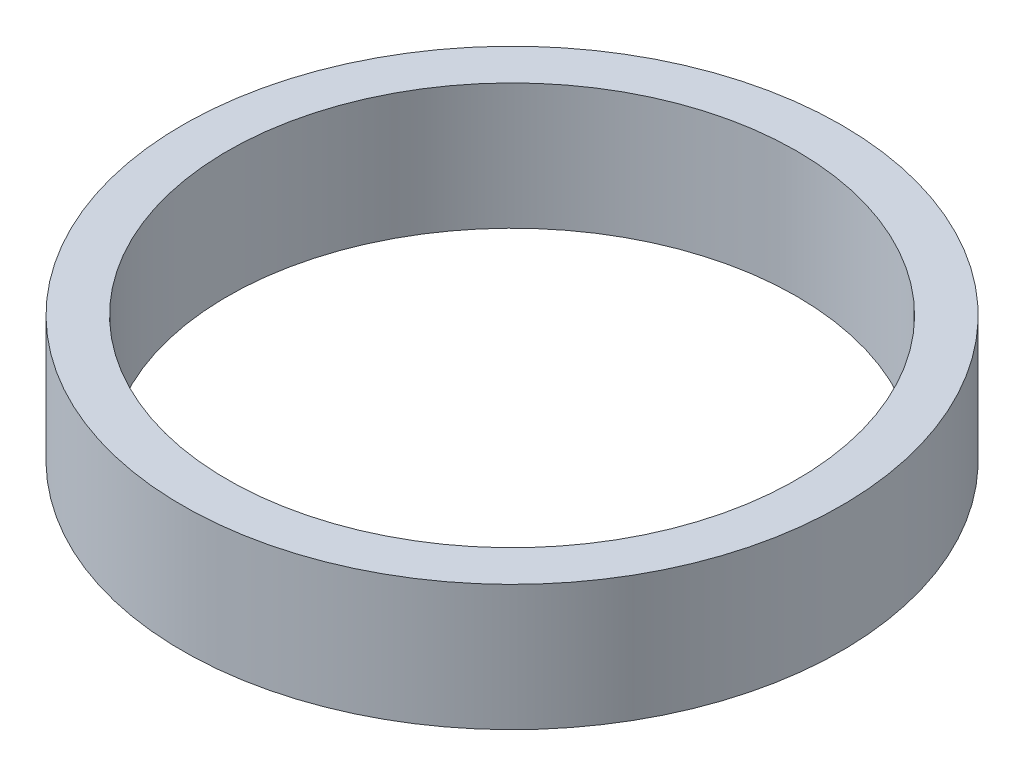
ISO-10303-21;
HEADER;
FILE_DESCRIPTION(('STEP AP214'),'2;1');
FILE_NAME('part.step','',(''),(''),'','','');
FILE_SCHEMA(('AUTOMOTIVE_DESIGN { 1 0 10303 214 1 1 1 1 }'));
ENDSEC;
DATA;
#1=APPLICATION_CONTEXT('core data for automotive mechanical design processes');
#2=APPLICATION_PROTOCOL_DEFINITION('international standard','automotive_design',2000,#1);
#3=PRODUCT_CONTEXT('',#1,'mechanical');
#4=PRODUCT('Part','Part','',(#3));
#5=PRODUCT_RELATED_PRODUCT_CATEGORY('part','',(#4));
#6=PRODUCT_DEFINITION_FORMATION('','',#4);
#7=PRODUCT_DEFINITION_CONTEXT('part definition',#1,'design');
#8=PRODUCT_DEFINITION('design','',#6,#7);
#9=PRODUCT_DEFINITION_SHAPE('','',#8);
#10=(LENGTH_UNIT() NAMED_UNIT(*) SI_UNIT(.MILLI.,.METRE.));
#11=(NAMED_UNIT(*) PLANE_ANGLE_UNIT() SI_UNIT($,.RADIAN.));
#12=(NAMED_UNIT(*) SI_UNIT($,.STERADIAN.) SOLID_ANGLE_UNIT());
#13=UNCERTAINTY_MEASURE_WITH_UNIT(LENGTH_MEASURE(1.E-05),#10,'distance_accuracy_value','');
#14=(GEOMETRIC_REPRESENTATION_CONTEXT(3) GLOBAL_UNCERTAINTY_ASSIGNED_CONTEXT((#13)) GLOBAL_UNIT_ASSIGNED_CONTEXT((#10,
#11,#12)) REPRESENTATION_CONTEXT('',''));
#15=CARTESIAN_POINT('',(0.,0.,0.));
#16=DIRECTION('',(0.,0.,1.));
#17=DIRECTION('',(1.,0.,0.));
#18=AXIS2_PLACEMENT_3D('',#15,#16,#17);
#19=CARTESIAN_POINT('',(0.,21.,0.));
#20=DIRECTION('',(0.,-1.,0.));
#21=DIRECTION('',(0.,0.,-1.));
#22=AXIS2_PLACEMENT_3D('',#19,#20,#21);
#23=CYLINDRICAL_SURFACE('',#22,55.);
#24=CARTESIAN_POINT('',(0.,21.,0.));
#25=DIRECTION('',(0.,1.,0.));
#26=DIRECTION('',(0.,0.,1.));
#27=AXIS2_PLACEMENT_3D('',#24,#25,#26);
#28=CIRCLE('',#27,55.);
#29=CARTESIAN_POINT('',(0.,21.,-55.));
#30=VERTEX_POINT('',#29);
#31=EDGE_CURVE('E10',#30,#30,#28,.T.);
#32=CARTESIAN_POINT('',(0.,0.,0.));
#33=DIRECTION('',(0.,1.,0.));
#34=DIRECTION('',(0.,0.,1.));
#35=AXIS2_PLACEMENT_3D('',#32,#33,#34);
#36=CIRCLE('',#35,55.);
#37=CARTESIAN_POINT('',(0.,0.,-55.));
#38=VERTEX_POINT('',#37);
#39=EDGE_CURVE('E37',#38,#38,#36,.T.);
#40=CARTESIAN_POINT('',(0.,21.,-55.));
#41=CARTESIAN_POINT('',(0.,20.78125,-55.));
#42=CARTESIAN_POINT('',(0.,20.5625,-55.));
#43=CARTESIAN_POINT('',(0.,20.125,-55.));
#44=CARTESIAN_POINT('',(0.,19.90625,-55.));
#45=CARTESIAN_POINT('',(0.,19.46875,-55.));
#46=CARTESIAN_POINT('',(0.,19.25,-55.));
#47=CARTESIAN_POINT('',(0.,18.8125,-55.));
#48=CARTESIAN_POINT('',(0.,18.59375,-55.));
#49=CARTESIAN_POINT('',(0.,18.15625,-55.));
#50=CARTESIAN_POINT('',(0.,17.9375,-55.));
#51=CARTESIAN_POINT('',(0.,17.5,-55.));
#52=CARTESIAN_POINT('',(0.,17.28125,-55.));
#53=CARTESIAN_POINT('',(0.,16.84375,-55.));
#54=CARTESIAN_POINT('',(0.,16.625,-55.));
#55=CARTESIAN_POINT('',(0.,16.1875,-55.));
#56=CARTESIAN_POINT('',(0.,15.96875,-55.));
#57=CARTESIAN_POINT('',(0.,15.53125,-55.));
#58=CARTESIAN_POINT('',(0.,15.3125,-55.));
#59=CARTESIAN_POINT('',(0.,14.875,-55.));
#60=CARTESIAN_POINT('',(0.,14.65625,-55.));
#61=CARTESIAN_POINT('',(0.,14.21875,-55.));
#62=CARTESIAN_POINT('',(0.,14.,-55.));
#63=CARTESIAN_POINT('',(0.,13.5625,-55.));
#64=CARTESIAN_POINT('',(0.,13.34375,-55.));
#65=CARTESIAN_POINT('',(0.,12.90625,-55.));
#66=CARTESIAN_POINT('',(0.,12.6875,-55.));
#67=CARTESIAN_POINT('',(0.,12.25,-55.));
#68=CARTESIAN_POINT('',(0.,12.03125,-55.));
#69=CARTESIAN_POINT('',(0.,11.59375,-55.));
#70=CARTESIAN_POINT('',(0.,11.375,-55.));
#71=CARTESIAN_POINT('',(0.,10.9375,-55.));
#72=CARTESIAN_POINT('',(0.,10.71875,-55.));
#73=CARTESIAN_POINT('',(0.,10.28125,-55.));
#74=CARTESIAN_POINT('',(0.,10.0625,-55.));
#75=CARTESIAN_POINT('',(0.,9.625,-55.));
#76=CARTESIAN_POINT('',(0.,9.40625,-55.));
#77=CARTESIAN_POINT('',(0.,8.96875,-55.));
#78=CARTESIAN_POINT('',(0.,8.75,-55.));
#79=CARTESIAN_POINT('',(0.,8.3125,-55.));
#80=CARTESIAN_POINT('',(0.,8.09375,-55.));
#81=CARTESIAN_POINT('',(0.,7.65625,-55.));
#82=CARTESIAN_POINT('',(0.,7.4375,-55.));
#83=CARTESIAN_POINT('',(0.,7.,-55.));
#84=CARTESIAN_POINT('',(0.,6.78125,-55.));
#85=CARTESIAN_POINT('',(0.,6.34375,-55.));
#86=CARTESIAN_POINT('',(0.,6.125,-55.));
#87=CARTESIAN_POINT('',(0.,5.6875,-55.));
#88=CARTESIAN_POINT('',(0.,5.46875,-55.));
#89=CARTESIAN_POINT('',(0.,5.03125,-55.));
#90=CARTESIAN_POINT('',(0.,4.8125,-55.));
#91=CARTESIAN_POINT('',(0.,4.375,-55.));
#92=CARTESIAN_POINT('',(0.,4.15625,-55.));
#93=CARTESIAN_POINT('',(0.,3.71875,-55.));
#94=CARTESIAN_POINT('',(0.,3.5,-55.));
#95=CARTESIAN_POINT('',(0.,3.0625,-55.));
#96=CARTESIAN_POINT('',(0.,2.84375,-55.));
#97=CARTESIAN_POINT('',(0.,2.40625,-55.));
#98=CARTESIAN_POINT('',(0.,2.1875,-55.));
#99=CARTESIAN_POINT('',(0.,1.75,-55.));
#100=CARTESIAN_POINT('',(0.,1.53125,-55.));
#101=CARTESIAN_POINT('',(0.,1.09375,-55.));
#102=CARTESIAN_POINT('',(0.,0.875000000000001,-55.));
#103=CARTESIAN_POINT('',(0.,0.4375,-55.));
#104=CARTESIAN_POINT('',(0.,0.21875,-55.));
#105=CARTESIAN_POINT('',(0.,0.,-55.));
#106=B_SPLINE_CURVE_WITH_KNOTS('',3,(#40,#41,#42,#43,#44,#45,#46,#47,#48,#49,#50,#51,#52,#53,
#54,#55,#56,#57,#58,#59,#60,#61,#62,#63,#64,#65,#66,#67,#68,#69,#70,#71,#72,#73,#74,#75,#76,#77,
#78,#79,#80,#81,#82,#83,#84,#85,#86,#87,#88,#89,#90,#91,#92,#93,#94,#95,#96,#97,#98,#99,#100,
#101,#102,#103,#104,#105),.UNSPECIFIED.,.F.,.F.,(4,2,2,2,2,2,2,2,2,2,2,2,2,2,2,2,2,2,2,2,2,2,2,
2,2,2,2,2,2,2,2,2,4),(0.,0.656250000000001,1.3125,1.96875,2.625,3.28125,3.9375,4.59375,5.25,
5.90625,6.5625,7.21875,7.875,8.53125,9.1875,9.84375,10.5,11.15625,11.8125,12.46875,13.125,
13.78125,14.4375,15.09375,15.75,16.40625,17.0625,17.71875,18.375,19.03125,19.6875,20.34375,21.),.UNSPECIFIED.);
#107=EDGE_CURVE('BSEAM40',#30,#38,#106,.T.);
#108=ORIENTED_EDGE('',*,*,#31,.F.);
#109=ORIENTED_EDGE('',*,*,#39,.T.);
#110=ORIENTED_EDGE('',*,*,#107,.T.);
#111=ORIENTED_EDGE('',*,*,#107,.F.);
#112=EDGE_LOOP('',(#108,#110,#109,#111));
#113=FACE_BOUND('',#112,.T.);
#114=ADVANCED_FACE('F40',(#113),#23,.T.);
#115=CARTESIAN_POINT('',(0.,21.,0.));
#116=DIRECTION('',(0.,1.,0.));
#117=DIRECTION('',(0.,0.,1.));
#118=AXIS2_PLACEMENT_3D('',#115,#116,#117);
#119=PLANE('',#118);
#120=CARTESIAN_POINT('',(0.,21.,0.));
#121=DIRECTION('',(0.,1.,0.));
#122=DIRECTION('',(0.,0.,1.));
#123=AXIS2_PLACEMENT_3D('',#120,#121,#122);
#124=CIRCLE('',#123,47.5);
#125=CARTESIAN_POINT('',(0.,21.,-47.5));
#126=VERTEX_POINT('',#125);
#127=EDGE_CURVE('E50',#126,#126,#124,.T.);
#128=ORIENTED_EDGE('',*,*,#127,.F.);
#129=EDGE_LOOP('',(#128));
#130=FACE_BOUND('',#129,.T.);
#131=ORIENTED_EDGE('',*,*,#31,.T.);
#132=EDGE_LOOP('',(#131));
#133=FACE_BOUND('',#132,.T.);
#134=ADVANCED_FACE('F59',(#130,#133),#119,.T.);
#135=CARTESIAN_POINT('',(0.,0.,0.));
#136=DIRECTION('',(0.,1.,0.));
#137=DIRECTION('',(0.,0.,1.));
#138=AXIS2_PLACEMENT_3D('',#135,#136,#137);
#139=PLANE('',#138);
#140=CARTESIAN_POINT('',(0.,0.,0.));
#141=DIRECTION('',(0.,1.,0.));
#142=DIRECTION('',(0.,0.,1.));
#143=AXIS2_PLACEMENT_3D('',#140,#141,#142);
#144=CIRCLE('',#143,47.5);
#145=CARTESIAN_POINT('',(0.,0.,-47.5));
#146=VERTEX_POINT('',#145);
#147=EDGE_CURVE('E47',#146,#146,#144,.T.);
#148=ORIENTED_EDGE('',*,*,#147,.T.);
#149=EDGE_LOOP('',(#148));
#150=FACE_BOUND('',#149,.T.);
#151=ORIENTED_EDGE('',*,*,#39,.F.);
#152=EDGE_LOOP('',(#151));
#153=FACE_BOUND('',#152,.T.);
#154=ADVANCED_FACE('F58',(#150,#153),#139,.F.);
#155=CARTESIAN_POINT('',(0.,21.,0.));
#156=DIRECTION('',(0.,-1.,0.));
#157=DIRECTION('',(0.,0.,-1.));
#158=AXIS2_PLACEMENT_3D('',#155,#156,#157);
#159=CYLINDRICAL_SURFACE('',#158,47.5);
#160=CARTESIAN_POINT('',(0.,21.,-47.5));
#161=CARTESIAN_POINT('',(0.,20.78125,-47.5));
#162=CARTESIAN_POINT('',(0.,20.5625,-47.5));
#163=CARTESIAN_POINT('',(0.,20.125,-47.5));
#164=CARTESIAN_POINT('',(0.,19.90625,-47.5));
#165=CARTESIAN_POINT('',(0.,19.46875,-47.5));
#166=CARTESIAN_POINT('',(0.,19.25,-47.5));
#167=CARTESIAN_POINT('',(0.,18.8125,-47.5));
#168=CARTESIAN_POINT('',(0.,18.59375,-47.5));
#169=CARTESIAN_POINT('',(0.,18.15625,-47.5));
#170=CARTESIAN_POINT('',(0.,17.9375,-47.5));
#171=CARTESIAN_POINT('',(0.,17.5,-47.5));
#172=CARTESIAN_POINT('',(0.,17.28125,-47.5));
#173=CARTESIAN_POINT('',(0.,16.84375,-47.5));
#174=CARTESIAN_POINT('',(0.,16.625,-47.5));
#175=CARTESIAN_POINT('',(0.,16.1875,-47.5));
#176=CARTESIAN_POINT('',(0.,15.96875,-47.5));
#177=CARTESIAN_POINT('',(0.,15.53125,-47.5));
#178=CARTESIAN_POINT('',(0.,15.3125,-47.5));
#179=CARTESIAN_POINT('',(0.,14.875,-47.5));
#180=CARTESIAN_POINT('',(0.,14.65625,-47.5));
#181=CARTESIAN_POINT('',(0.,14.21875,-47.5));
#182=CARTESIAN_POINT('',(0.,14.,-47.5));
#183=CARTESIAN_POINT('',(0.,13.5625,-47.5));
#184=CARTESIAN_POINT('',(0.,13.34375,-47.5));
#185=CARTESIAN_POINT('',(0.,12.90625,-47.5));
#186=CARTESIAN_POINT('',(0.,12.6875,-47.5));
#187=CARTESIAN_POINT('',(0.,12.25,-47.5));
#188=CARTESIAN_POINT('',(0.,12.03125,-47.5));
#189=CARTESIAN_POINT('',(0.,11.59375,-47.5));
#190=CARTESIAN_POINT('',(0.,11.375,-47.5));
#191=CARTESIAN_POINT('',(0.,10.9375,-47.5));
#192=CARTESIAN_POINT('',(0.,10.71875,-47.5));
#193=CARTESIAN_POINT('',(0.,10.28125,-47.5));
#194=CARTESIAN_POINT('',(0.,10.0625,-47.5));
#195=CARTESIAN_POINT('',(0.,9.625,-47.5));
#196=CARTESIAN_POINT('',(0.,9.40625,-47.5));
#197=CARTESIAN_POINT('',(0.,8.96875,-47.5));
#198=CARTESIAN_POINT('',(0.,8.75,-47.5));
#199=CARTESIAN_POINT('',(0.,8.3125,-47.5));
#200=CARTESIAN_POINT('',(0.,8.09375,-47.5));
#201=CARTESIAN_POINT('',(0.,7.65625,-47.5));
#202=CARTESIAN_POINT('',(0.,7.4375,-47.5));
#203=CARTESIAN_POINT('',(0.,7.,-47.5));
#204=CARTESIAN_POINT('',(0.,6.78125,-47.5));
#205=CARTESIAN_POINT('',(0.,6.34375,-47.5));
#206=CARTESIAN_POINT('',(0.,6.125,-47.5));
#207=CARTESIAN_POINT('',(0.,5.6875,-47.5));
#208=CARTESIAN_POINT('',(0.,5.46875,-47.5));
#209=CARTESIAN_POINT('',(0.,5.03125,-47.5));
#210=CARTESIAN_POINT('',(0.,4.8125,-47.5));
#211=CARTESIAN_POINT('',(0.,4.375,-47.5));
#212=CARTESIAN_POINT('',(0.,4.15625,-47.5));
#213=CARTESIAN_POINT('',(0.,3.71875,-47.5));
#214=CARTESIAN_POINT('',(0.,3.5,-47.5));
#215=CARTESIAN_POINT('',(0.,3.0625,-47.5));
#216=CARTESIAN_POINT('',(0.,2.84375,-47.5));
#217=CARTESIAN_POINT('',(0.,2.40625,-47.5));
#218=CARTESIAN_POINT('',(0.,2.1875,-47.5));
#219=CARTESIAN_POINT('',(0.,1.75,-47.5));
#220=CARTESIAN_POINT('',(0.,1.53125,-47.5));
#221=CARTESIAN_POINT('',(0.,1.09375,-47.5));
#222=CARTESIAN_POINT('',(0.,0.875000000000001,-47.5));
#223=CARTESIAN_POINT('',(0.,0.4375,-47.5));
#224=CARTESIAN_POINT('',(0.,0.21875,-47.5));
#225=CARTESIAN_POINT('',(0.,0.,-47.5));
#226=B_SPLINE_CURVE_WITH_KNOTS('',3,(#160,#161,#162,#163,#164,#165,#166,#167,#168,#169,#170,
#171,#172,#173,#174,#175,#176,#177,#178,#179,#180,#181,#182,#183,#184,#185,#186,#187,#188,#189,
#190,#191,#192,#193,#194,#195,#196,#197,#198,#199,#200,#201,#202,#203,#204,#205,#206,#207,#208,
#209,#210,#211,#212,#213,#214,#215,#216,#217,#218,#219,#220,#221,#222,#223,#224,#225),
.UNSPECIFIED.,.F.,.F.,(4,2,2,2,2,2,2,2,2,2,2,2,2,2,2,2,2,2,2,2,2,2,2,2,2,2,2,2,2,2,2,2,4),(0.,
0.656249999999997,1.3125,1.96875,2.625,3.28125,3.9375,4.59375,5.25,5.90625,6.5625,7.21875,7.875,
8.53125,9.1875,9.84375,10.5,11.15625,11.8125,12.46875,13.125,13.78125,14.4375,15.09375,15.75,
16.40625,17.0625,17.71875,18.375,19.03125,19.6875,20.34375,21.),.UNSPECIFIED.);
#227=EDGE_CURVE('BSEAM54',#126,#146,#226,.T.);
#228=ORIENTED_EDGE('',*,*,#127,.T.);
#229=ORIENTED_EDGE('',*,*,#147,.F.);
#230=ORIENTED_EDGE('',*,*,#227,.T.);
#231=ORIENTED_EDGE('',*,*,#227,.F.);
#232=EDGE_LOOP('',(#228,#230,#229,#231));
#233=FACE_BOUND('',#232,.T.);
#234=ADVANCED_FACE('F54',(#233),#159,.F.);
#235=CLOSED_SHELL('',(#114,#134,#154,#234));
#236=MANIFOLD_SOLID_BREP('B2',#235);
#237=ADVANCED_BREP_SHAPE_REPRESENTATION('',(#18,#236),#14);
#238=SHAPE_DEFINITION_REPRESENTATION(#9,#237);
ENDSEC;
END-ISO-10303-21;
